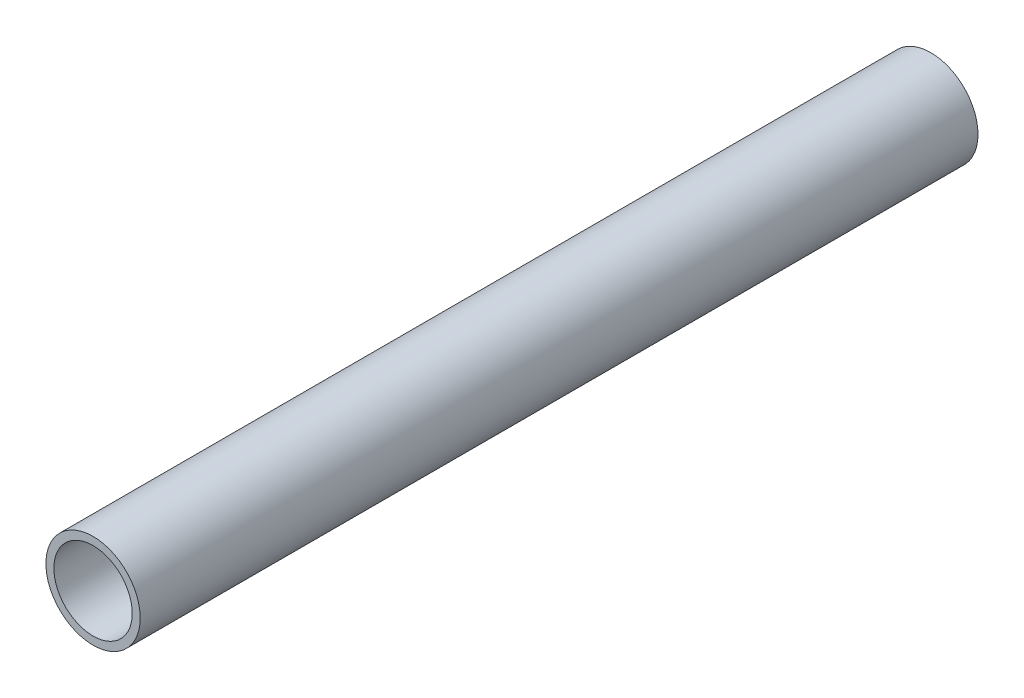
ISO-10303-21;
HEADER;
FILE_DESCRIPTION(('STEP AP214'),'2;1');
FILE_NAME('part.step','',(''),(''),'','','');
FILE_SCHEMA(('AUTOMOTIVE_DESIGN { 1 0 10303 214 1 1 1 1 }'));
ENDSEC;
DATA;
#1=APPLICATION_CONTEXT('core data for automotive mechanical design processes');
#2=APPLICATION_PROTOCOL_DEFINITION('international standard','automotive_design',2000,#1);
#3=PRODUCT_CONTEXT('',#1,'mechanical');
#4=PRODUCT('Part','Part','',(#3));
#5=PRODUCT_RELATED_PRODUCT_CATEGORY('part','',(#4));
#6=PRODUCT_DEFINITION_FORMATION('','',#4);
#7=PRODUCT_DEFINITION_CONTEXT('part definition',#1,'design');
#8=PRODUCT_DEFINITION('design','',#6,#7);
#9=PRODUCT_DEFINITION_SHAPE('','',#8);
#10=(LENGTH_UNIT() NAMED_UNIT(*) SI_UNIT(.MILLI.,.METRE.));
#11=(NAMED_UNIT(*) PLANE_ANGLE_UNIT() SI_UNIT($,.RADIAN.));
#12=(NAMED_UNIT(*) SI_UNIT($,.STERADIAN.) SOLID_ANGLE_UNIT());
#13=UNCERTAINTY_MEASURE_WITH_UNIT(LENGTH_MEASURE(1.E-05),#10,'distance_accuracy_value','');
#14=(GEOMETRIC_REPRESENTATION_CONTEXT(3) GLOBAL_UNCERTAINTY_ASSIGNED_CONTEXT((#13)) GLOBAL_UNIT_ASSIGNED_CONTEXT((#10,
#11,#12)) REPRESENTATION_CONTEXT('',''));
#15=CARTESIAN_POINT('',(0.,0.,0.));
#16=DIRECTION('',(0.,0.,1.));
#17=DIRECTION('',(1.,0.,0.));
#18=AXIS2_PLACEMENT_3D('',#15,#16,#17);
#19=CARTESIAN_POINT('',(0.,0.,0.));
#20=DIRECTION('',(0.,0.,1.));
#21=DIRECTION('',(1.,0.,0.));
#22=AXIS2_PLACEMENT_3D('',#19,#20,#21);
#23=CYLINDRICAL_SURFACE('',#22,17.526);
#24=CARTESIAN_POINT('',(0.,0.,374.65));
#25=DIRECTION('',(0.,0.,1.));
#26=DIRECTION('',(1.,0.,0.));
#27=AXIS2_PLACEMENT_3D('',#24,#25,#26);
#28=CIRCLE('',#27,17.526);
#29=CARTESIAN_POINT('',(17.526,0.,374.65));
#30=VERTEX_POINT('',#29);
#31=EDGE_CURVE('E17',#30,#30,#28,.F.);
#32=ORIENTED_EDGE('',*,*,#31,.F.);
#33=EDGE_LOOP('',(#32));
#34=FACE_BOUND('',#33,.T.);
#35=CARTESIAN_POINT('',(0.,0.,0.));
#36=DIRECTION('',(0.,0.,1.));
#37=DIRECTION('',(1.,0.,0.));
#38=AXIS2_PLACEMENT_3D('',#35,#36,#37);
#39=CIRCLE('',#38,17.526);
#40=CARTESIAN_POINT('',(17.526,0.,0.));
#41=VERTEX_POINT('',#40);
#42=EDGE_CURVE('E26',#41,#41,#39,.F.);
#43=ORIENTED_EDGE('',*,*,#42,.T.);
#44=EDGE_LOOP('',(#43));
#45=FACE_BOUND('',#44,.T.);
#46=ADVANCED_FACE('F14',(#34,#45),#23,.F.);
#47=CARTESIAN_POINT('',(0.,0.,374.65));
#48=DIRECTION('',(0.,0.,1.));
#49=DIRECTION('',(1.,0.,0.));
#50=AXIS2_PLACEMENT_3D('',#47,#48,#49);
#51=PLANE('',#50);
#52=ORIENTED_EDGE('',*,*,#31,.T.);
#53=EDGE_LOOP('',(#52));
#54=FACE_BOUND('',#53,.T.);
#55=CARTESIAN_POINT('',(0.,0.,374.65));
#56=DIRECTION('',(0.,0.,1.));
#57=DIRECTION('',(1.,0.,0.));
#58=AXIS2_PLACEMENT_3D('',#55,#56,#57);
#59=CIRCLE('',#58,21.082);
#60=CARTESIAN_POINT('',(21.082,0.,374.65));
#61=VERTEX_POINT('',#60);
#62=EDGE_CURVE('E21',#61,#61,#59,.F.);
#63=ORIENTED_EDGE('',*,*,#62,.F.);
#64=EDGE_LOOP('',(#63));
#65=FACE_BOUND('',#64,.T.);
#66=ADVANCED_FACE('F34',(#54,#65),#51,.T.);
#67=CARTESIAN_POINT('',(0.,0.,0.));
#68=DIRECTION('',(0.,0.,1.));
#69=DIRECTION('',(1.,0.,0.));
#70=AXIS2_PLACEMENT_3D('',#67,#68,#69);
#71=PLANE('',#70);
#72=ORIENTED_EDGE('',*,*,#42,.F.);
#73=EDGE_LOOP('',(#72));
#74=FACE_BOUND('',#73,.T.);
#75=CARTESIAN_POINT('',(0.,0.,0.));
#76=DIRECTION('',(0.,0.,1.));
#77=DIRECTION('',(1.,0.,0.));
#78=AXIS2_PLACEMENT_3D('',#75,#76,#77);
#79=CIRCLE('',#78,21.082);
#80=CARTESIAN_POINT('',(21.082,0.,0.));
#81=VERTEX_POINT('',#80);
#82=EDGE_CURVE('E10',#81,#81,#79,.T.);
#83=ORIENTED_EDGE('',*,*,#82,.F.);
#84=EDGE_LOOP('',(#83));
#85=FACE_BOUND('',#84,.T.);
#86=ADVANCED_FACE('F42',(#74,#85),#71,.F.);
#87=CARTESIAN_POINT('',(0.,0.,0.));
#88=DIRECTION('',(0.,0.,1.));
#89=DIRECTION('',(1.,0.,0.));
#90=AXIS2_PLACEMENT_3D('',#87,#88,#89);
#91=CYLINDRICAL_SURFACE('',#90,21.082);
#92=ORIENTED_EDGE('',*,*,#62,.T.);
#93=EDGE_LOOP('',(#92));
#94=FACE_BOUND('',#93,.T.);
#95=ORIENTED_EDGE('',*,*,#82,.T.);
#96=EDGE_LOOP('',(#95));
#97=FACE_BOUND('',#96,.T.);
#98=ADVANCED_FACE('F43',(#94,#97),#91,.T.);
#99=CLOSED_SHELL('',(#46,#66,#86,#98));
#100=MANIFOLD_SOLID_BREP('B1',#99);
#101=ADVANCED_BREP_SHAPE_REPRESENTATION('',(#18,#100),#14);
#102=SHAPE_DEFINITION_REPRESENTATION(#9,#101);
ENDSEC;
END-ISO-10303-21;
